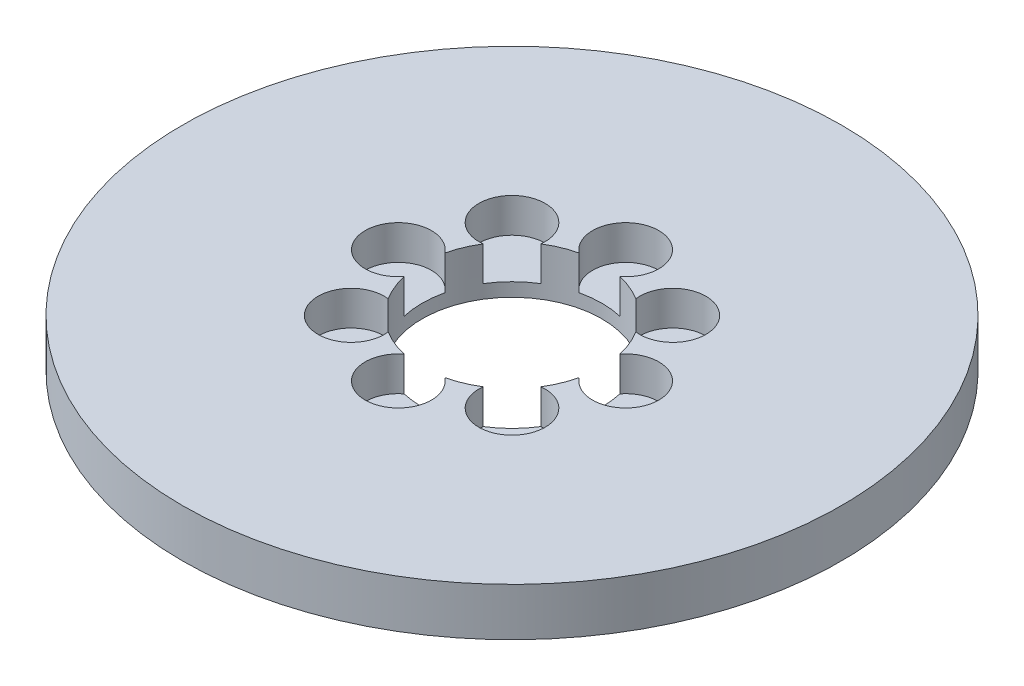
ISO-10303-21;
HEADER;
FILE_DESCRIPTION(('STEP AP214'),'2;1');
FILE_NAME('part.step','',(''),(''),'','','');
FILE_SCHEMA(('AUTOMOTIVE_DESIGN { 1 0 10303 214 1 1 1 1 }'));
ENDSEC;
DATA;
#1=APPLICATION_CONTEXT('core data for automotive mechanical design processes');
#2=APPLICATION_PROTOCOL_DEFINITION('international standard','automotive_design',2000,#1);
#3=PRODUCT_CONTEXT('',#1,'mechanical');
#4=PRODUCT('Part','Part','',(#3));
#5=PRODUCT_RELATED_PRODUCT_CATEGORY('part','',(#4));
#6=PRODUCT_DEFINITION_FORMATION('','',#4);
#7=PRODUCT_DEFINITION_CONTEXT('part definition',#1,'design');
#8=PRODUCT_DEFINITION('design','',#6,#7);
#9=PRODUCT_DEFINITION_SHAPE('','',#8);
#10=(LENGTH_UNIT() NAMED_UNIT(*) SI_UNIT(.MILLI.,.METRE.));
#11=(NAMED_UNIT(*) PLANE_ANGLE_UNIT() SI_UNIT($,.RADIAN.));
#12=(NAMED_UNIT(*) SI_UNIT($,.STERADIAN.) SOLID_ANGLE_UNIT());
#13=UNCERTAINTY_MEASURE_WITH_UNIT(LENGTH_MEASURE(1.E-05),#10,'distance_accuracy_value','');
#14=(GEOMETRIC_REPRESENTATION_CONTEXT(3) GLOBAL_UNCERTAINTY_ASSIGNED_CONTEXT((#13)) GLOBAL_UNIT_ASSIGNED_CONTEXT((#10,
#11,#12)) REPRESENTATION_CONTEXT('',''));
#15=CARTESIAN_POINT('',(0.,0.,0.));
#16=DIRECTION('',(0.,0.,1.));
#17=DIRECTION('',(1.,0.,0.));
#18=AXIS2_PLACEMENT_3D('',#15,#16,#17);
#19=CARTESIAN_POINT('',(0.,4.,0.));
#20=DIRECTION('',(0.,-1.,0.));
#21=DIRECTION('',(0.,0.,-1.));
#22=AXIS2_PLACEMENT_3D('',#19,#20,#21);
#23=CYLINDRICAL_SURFACE('',#22,27.5);
#24=CARTESIAN_POINT('',(0.,4.,0.));
#25=DIRECTION('',(0.,1.,0.));
#26=DIRECTION('',(0.,0.,1.));
#27=AXIS2_PLACEMENT_3D('',#24,#25,#26);
#28=CIRCLE('',#27,27.5);
#29=CARTESIAN_POINT('',(0.,4.,27.5));
#30=VERTEX_POINT('',#29);
#31=EDGE_CURVE('E195',#30,#30,#28,.T.);
#32=ORIENTED_EDGE('',*,*,#31,.F.);
#33=EDGE_LOOP('',(#32));
#34=FACE_BOUND('',#33,.T.);
#35=CARTESIAN_POINT('',(0.,0.,0.));
#36=DIRECTION('',(0.,1.,0.));
#37=DIRECTION('',(0.,0.,1.));
#38=AXIS2_PLACEMENT_3D('',#35,#36,#37);
#39=CIRCLE('',#38,27.5);
#40=CARTESIAN_POINT('',(0.,0.,27.5));
#41=VERTEX_POINT('',#40);
#42=EDGE_CURVE('E179',#41,#41,#39,.T.);
#43=ORIENTED_EDGE('',*,*,#42,.T.);
#44=EDGE_LOOP('',(#43));
#45=FACE_BOUND('',#44,.T.);
#46=ADVANCED_FACE('F39',(#34,#45),#23,.T.);
#47=CARTESIAN_POINT('',(0.,4.,0.));
#48=DIRECTION('',(0.,1.,0.));
#49=DIRECTION('',(0.,0.,1.));
#50=AXIS2_PLACEMENT_3D('',#47,#48,#49);
#51=PLANE('',#50);
#52=CARTESIAN_POINT('',(0.,4.,9.48682815925262));
#53=DIRECTION('',(0.,1.,0.));
#54=DIRECTION('',(1.,0.,0.));
#55=AXIS2_PLACEMENT_3D('',#52,#53,#54);
#56=CIRCLE('',#55,2.7653774742238);
#57=CARTESIAN_POINT('',(-1.69910178107267,4.,7.30500192591047));
#58=VERTEX_POINT('',#57);
#59=CARTESIAN_POINT('',(1.69910178107272,4.,7.30500192591046));
#60=VERTEX_POINT('',#59);
#61=EDGE_CURVE('E176',#58,#60,#56,.T.);
#62=ORIENTED_EDGE('',*,*,#61,.F.);
#63=CARTESIAN_POINT('',(0.,4.,0.));
#64=DIRECTION('',(0.,1.,0.));
#65=DIRECTION('',(0.,0.,1.));
#66=AXIS2_PLACEMENT_3D('',#63,#64,#65);
#67=CIRCLE('',#66,7.5);
#68=CARTESIAN_POINT('',(-3.96397000706943,4.,6.36686278971472));
#69=VERTEX_POINT('',#68);
#70=EDGE_CURVE('E166',#69,#58,#67,.T.);
#71=ORIENTED_EDGE('',*,*,#70,.F.);
#72=CARTESIAN_POINT('',(-6.70820052335901,4.,6.70820052335903));
#73=DIRECTION('',(0.,1.,0.));
#74=DIRECTION('',(0.707106781186549,0.,0.707106781186546));
#75=AXIS2_PLACEMENT_3D('',#72,#73,#74);
#76=CIRCLE('',#75,2.7653774742238);
#77=CARTESIAN_POINT('',(-6.36686278971471,4.,3.96397000706945));
#78=VERTEX_POINT('',#77);
#79=EDGE_CURVE('E147',#78,#69,#76,.T.);
#80=ORIENTED_EDGE('',*,*,#79,.F.);
#81=CARTESIAN_POINT('',(-7.30500192591046,4.,1.69910178107269));
#82=VERTEX_POINT('',#81);
#83=EDGE_CURVE('E180',#82,#78,#67,.T.);
#84=ORIENTED_EDGE('',*,*,#83,.F.);
#85=CARTESIAN_POINT('',(-9.48682815925262,4.,0.));
#86=DIRECTION('',(0.,1.,0.));
#87=DIRECTION('',(0.,0.,1.));
#88=AXIS2_PLACEMENT_3D('',#85,#86,#87);
#89=CIRCLE('',#88,2.7653774742238);
#90=CARTESIAN_POINT('',(-7.30500192591046,4.,-1.69910178107269));
#91=VERTEX_POINT('',#90);
#92=EDGE_CURVE('E186',#91,#82,#89,.T.);
#93=ORIENTED_EDGE('',*,*,#92,.F.);
#94=CARTESIAN_POINT('',(-6.36686278971477,4.,-3.96397000706936));
#95=VERTEX_POINT('',#94);
#96=EDGE_CURVE('E182',#95,#91,#67,.T.);
#97=ORIENTED_EDGE('',*,*,#96,.F.);
#98=CARTESIAN_POINT('',(-6.7082005233591,4.,-6.70820052335894));
#99=DIRECTION('',(0.,1.,0.));
#100=DIRECTION('',(-0.707106781186539,0.,0.707106781186556));
#101=AXIS2_PLACEMENT_3D('',#98,#99,#100);
#102=CIRCLE('',#101,2.7653774742238);
#103=CARTESIAN_POINT('',(-3.96397000706952,4.,-6.36686278971467));
#104=VERTEX_POINT('',#103);
#105=EDGE_CURVE('E446',#104,#95,#102,.T.);
#106=ORIENTED_EDGE('',*,*,#105,.F.);
#107=CARTESIAN_POINT('',(-1.69910178107277,4.,-7.30500192591045));
#108=VERTEX_POINT('',#107);
#109=EDGE_CURVE('E452',#108,#104,#67,.T.);
#110=ORIENTED_EDGE('',*,*,#109,.F.);
#111=CARTESIAN_POINT('',(0.,4.,-9.48682815925262));
#112=DIRECTION('',(0.,1.,0.));
#113=DIRECTION('',(-1.,0.,0.));
#114=AXIS2_PLACEMENT_3D('',#111,#112,#113);
#115=CIRCLE('',#114,2.7653774742238);
#116=CARTESIAN_POINT('',(1.69910178107262,4.,-7.30500192591048));
#117=VERTEX_POINT('',#116);
#118=EDGE_CURVE('E477',#117,#108,#115,.T.);
#119=ORIENTED_EDGE('',*,*,#118,.F.);
#120=CARTESIAN_POINT('',(3.96397000706938,4.,-6.36686278971475));
#121=VERTEX_POINT('',#120);
#122=EDGE_CURVE('E460',#121,#117,#67,.T.);
#123=ORIENTED_EDGE('',*,*,#122,.F.);
#124=CARTESIAN_POINT('',(6.70820052335896,4.,-6.70820052335908));
#125=DIRECTION('',(0.,1.,0.));
#126=DIRECTION('',(-0.707106781186554,0.,-0.707106781186541));
#127=AXIS2_PLACEMENT_3D('',#124,#125,#126);
#128=CIRCLE('',#127,2.7653774742238);
#129=CARTESIAN_POINT('',(6.36686278971469,4.,-3.96397000706949));
#130=VERTEX_POINT('',#129);
#131=EDGE_CURVE('E464',#130,#121,#128,.T.);
#132=ORIENTED_EDGE('',*,*,#131,.F.);
#133=CARTESIAN_POINT('',(7.30500192591046,4.,-1.69910178107269));
#134=VERTEX_POINT('',#133);
#135=EDGE_CURVE('E459',#134,#130,#67,.T.);
#136=ORIENTED_EDGE('',*,*,#135,.F.);
#137=CARTESIAN_POINT('',(9.48682815925262,4.,0.));
#138=DIRECTION('',(0.,1.,0.));
#139=DIRECTION('',(0.,0.,-1.));
#140=AXIS2_PLACEMENT_3D('',#137,#138,#139);
#141=CIRCLE('',#140,2.7653774742238);
#142=CARTESIAN_POINT('',(7.30500192591046,4.,1.69910178107269));
#143=VERTEX_POINT('',#142);
#144=EDGE_CURVE('E469',#143,#134,#141,.T.);
#145=ORIENTED_EDGE('',*,*,#144,.F.);
#146=CARTESIAN_POINT('',(6.36686278971474,4.,3.9639700070694));
#147=VERTEX_POINT('',#146);
#148=EDGE_CURVE('E181',#147,#143,#67,.T.);
#149=ORIENTED_EDGE('',*,*,#148,.F.);
#150=CARTESIAN_POINT('',(6.70820052335906,4.,6.70820052335898));
#151=DIRECTION('',(0.,1.,0.));
#152=DIRECTION('',(0.707106781186544,0.,-0.707106781186551));
#153=AXIS2_PLACEMENT_3D('',#150,#151,#152);
#154=CIRCLE('',#153,2.7653774742238);
#155=CARTESIAN_POINT('',(3.96397000706947,4.,6.3668627897147));
#156=VERTEX_POINT('',#155);
#157=EDGE_CURVE('E475',#156,#147,#154,.T.);
#158=ORIENTED_EDGE('',*,*,#157,.F.);
#159=EDGE_CURVE('E177',#60,#156,#67,.T.);
#160=ORIENTED_EDGE('',*,*,#159,.F.);
#161=EDGE_LOOP('',(#62,#71,#80,#84,#93,#97,#106,#110,#119,#123,#132,#136,#145,#149,#158,#160));
#162=FACE_BOUND('',#161,.T.);
#163=ORIENTED_EDGE('',*,*,#31,.T.);
#164=EDGE_LOOP('',(#163));
#165=FACE_BOUND('',#164,.T.);
#166=ADVANCED_FACE('F172',(#162,#165),#51,.T.);
#167=CARTESIAN_POINT('',(0.,0.,0.));
#168=DIRECTION('',(0.,1.,0.));
#169=DIRECTION('',(0.,0.,1.));
#170=AXIS2_PLACEMENT_3D('',#167,#168,#169);
#171=PLANE('',#170);
#172=CARTESIAN_POINT('',(0.,0.,0.));
#173=DIRECTION('',(0.,1.,0.));
#174=DIRECTION('',(0.,0.,1.));
#175=AXIS2_PLACEMENT_3D('',#172,#173,#174);
#176=CIRCLE('',#175,7.5);
#177=CARTESIAN_POINT('',(0.,0.,7.5));
#178=VERTEX_POINT('',#177);
#179=EDGE_CURVE('E187',#178,#178,#176,.T.);
#180=ORIENTED_EDGE('',*,*,#179,.T.);
#181=EDGE_LOOP('',(#180));
#182=FACE_BOUND('',#181,.T.);
#183=ORIENTED_EDGE('',*,*,#42,.F.);
#184=EDGE_LOOP('',(#183));
#185=FACE_BOUND('',#184,.T.);
#186=ADVANCED_FACE('F270',(#182,#185),#171,.F.);
#187=CARTESIAN_POINT('',(0.,4.,0.));
#188=DIRECTION('',(0.,-1.,0.));
#189=DIRECTION('',(0.,0.,-1.));
#190=AXIS2_PLACEMENT_3D('',#187,#188,#189);
#191=CYLINDRICAL_SURFACE('',#190,7.5);
#192=DIRECTION('',(0.,1.,0.));
#193=VECTOR('',#192,1.);
#194=CARTESIAN_POINT('',(-1.69910178107267,2.56374184246657,7.30500192591047));
#195=LINE('',#194,#193);
#196=CARTESIAN_POINT('',(-1.69910178107267,1.12748368493314,7.30500192591047));
#197=VERTEX_POINT('',#196);
#198=EDGE_CURVE('E11',#197,#58,#195,.T.);
#199=ORIENTED_EDGE('',*,*,#198,.F.);
#200=CARTESIAN_POINT('',(0.,1.12748368493314,0.));
#201=DIRECTION('',(0.,1.,0.));
#202=DIRECTION('',(0.,0.,1.));
#203=AXIS2_PLACEMENT_3D('',#200,#201,#202);
#204=CIRCLE('',#203,7.5);
#205=CARTESIAN_POINT('',(1.69910178107272,1.12748368493314,7.30500192591046));
#206=VERTEX_POINT('',#205);
#207=EDGE_CURVE('E250',#197,#206,#204,.T.);
#208=ORIENTED_EDGE('',*,*,#207,.T.);
#209=DIRECTION('',(0.,1.,0.));
#210=VECTOR('',#209,1.);
#211=CARTESIAN_POINT('',(1.69910178107272,2.56374184246657,7.30500192591046));
#212=LINE('',#211,#210);
#213=EDGE_CURVE('E46',#60,#206,#212,.F.);
#214=ORIENTED_EDGE('',*,*,#213,.F.);
#215=ORIENTED_EDGE('',*,*,#159,.T.);
#216=DIRECTION('',(0.,1.,0.));
#217=VECTOR('',#216,1.);
#218=CARTESIAN_POINT('',(3.96397000706947,2.56374184246657,6.3668627897147));
#219=LINE('',#218,#217);
#220=CARTESIAN_POINT('',(3.96397000706947,1.12748368493314,6.3668627897147));
#221=VERTEX_POINT('',#220);
#222=EDGE_CURVE('E244',#221,#156,#219,.T.);
#223=ORIENTED_EDGE('',*,*,#222,.F.);
#224=CARTESIAN_POINT('',(0.,1.12748368493314,0.));
#225=DIRECTION('',(0.,1.,0.));
#226=DIRECTION('',(0.,0.,1.));
#227=AXIS2_PLACEMENT_3D('',#224,#225,#226);
#228=CIRCLE('',#227,7.5);
#229=CARTESIAN_POINT('',(6.36686278971474,1.12748368493314,3.9639700070694));
#230=VERTEX_POINT('',#229);
#231=EDGE_CURVE('E238',#221,#230,#228,.T.);
#232=ORIENTED_EDGE('',*,*,#231,.T.);
#233=DIRECTION('',(0.,1.,0.));
#234=VECTOR('',#233,1.);
#235=CARTESIAN_POINT('',(6.36686278971474,2.56374184246657,3.9639700070694));
#236=LINE('',#235,#234);
#237=EDGE_CURVE('E242',#147,#230,#236,.F.);
#238=ORIENTED_EDGE('',*,*,#237,.F.);
#239=ORIENTED_EDGE('',*,*,#148,.T.);
#240=DIRECTION('',(0.,1.,0.));
#241=VECTOR('',#240,1.);
#242=CARTESIAN_POINT('',(7.30500192591047,2.56374184246657,1.69910178107269));
#243=LINE('',#242,#241);
#244=CARTESIAN_POINT('',(7.30500192591046,1.12748368493314,1.69910178107269));
#245=VERTEX_POINT('',#244);
#246=EDGE_CURVE('E236',#245,#143,#243,.T.);
#247=ORIENTED_EDGE('',*,*,#246,.F.);
#248=CARTESIAN_POINT('',(0.,1.12748368493314,0.));
#249=DIRECTION('',(0.,1.,0.));
#250=DIRECTION('',(0.,0.,1.));
#251=AXIS2_PLACEMENT_3D('',#248,#249,#250);
#252=CIRCLE('',#251,7.5);
#253=CARTESIAN_POINT('',(7.30500192591046,1.12748368493314,-1.69910178107269));
#254=VERTEX_POINT('',#253);
#255=EDGE_CURVE('E235',#245,#254,#252,.T.);
#256=ORIENTED_EDGE('',*,*,#255,.T.);
#257=DIRECTION('',(0.,1.,0.));
#258=VECTOR('',#257,1.);
#259=CARTESIAN_POINT('',(7.30500192591047,2.56374184246657,-1.69910178107269));
#260=LINE('',#259,#258);
#261=EDGE_CURVE('E234',#134,#254,#260,.F.);
#262=ORIENTED_EDGE('',*,*,#261,.F.);
#263=ORIENTED_EDGE('',*,*,#135,.T.);
#264=DIRECTION('',(0.,1.,0.));
#265=VECTOR('',#264,1.);
#266=CARTESIAN_POINT('',(6.36686278971469,2.56374184246657,-3.96397000706949));
#267=LINE('',#266,#265);
#268=CARTESIAN_POINT('',(6.36686278971469,1.12748368493314,-3.96397000706949));
#269=VERTEX_POINT('',#268);
#270=EDGE_CURVE('E229',#269,#130,#267,.T.);
#271=ORIENTED_EDGE('',*,*,#270,.F.);
#272=CARTESIAN_POINT('',(0.,1.12748368493314,0.));
#273=DIRECTION('',(0.,1.,0.));
#274=DIRECTION('',(0.,0.,1.));
#275=AXIS2_PLACEMENT_3D('',#272,#273,#274);
#276=CIRCLE('',#275,7.5);
#277=CARTESIAN_POINT('',(3.96397000706938,1.12748368493314,-6.36686278971475));
#278=VERTEX_POINT('',#277);
#279=EDGE_CURVE('E221',#269,#278,#276,.T.);
#280=ORIENTED_EDGE('',*,*,#279,.T.);
#281=DIRECTION('',(0.,1.,0.));
#282=VECTOR('',#281,1.);
#283=CARTESIAN_POINT('',(3.96397000706938,2.56374184246657,-6.36686278971476));
#284=LINE('',#283,#282);
#285=EDGE_CURVE('E230',#121,#278,#284,.F.);
#286=ORIENTED_EDGE('',*,*,#285,.F.);
#287=ORIENTED_EDGE('',*,*,#122,.T.);
#288=DIRECTION('',(0.,1.,0.));
#289=VECTOR('',#288,1.);
#290=CARTESIAN_POINT('',(1.69910178107262,2.56374184246657,-7.30500192591048));
#291=LINE('',#290,#289);
#292=CARTESIAN_POINT('',(1.69910178107262,1.12748368493314,-7.30500192591048));
#293=VERTEX_POINT('',#292);
#294=EDGE_CURVE('E225',#293,#117,#291,.T.);
#295=ORIENTED_EDGE('',*,*,#294,.F.);
#296=CARTESIAN_POINT('',(0.,1.12748368493314,0.));
#297=DIRECTION('',(0.,1.,0.));
#298=DIRECTION('',(0.,0.,1.));
#299=AXIS2_PLACEMENT_3D('',#296,#297,#298);
#300=CIRCLE('',#299,7.5);
#301=CARTESIAN_POINT('',(-1.69910178107277,1.12748368493314,-7.30500192591045));
#302=VERTEX_POINT('',#301);
#303=EDGE_CURVE('E216',#293,#302,#300,.T.);
#304=ORIENTED_EDGE('',*,*,#303,.T.);
#305=DIRECTION('',(0.,1.,0.));
#306=VECTOR('',#305,1.);
#307=CARTESIAN_POINT('',(-1.69910178107277,2.56374184246657,-7.30500192591045));
#308=LINE('',#307,#306);
#309=EDGE_CURVE('E218',#108,#302,#308,.F.);
#310=ORIENTED_EDGE('',*,*,#309,.F.);
#311=ORIENTED_EDGE('',*,*,#109,.T.);
#312=DIRECTION('',(0.,1.,0.));
#313=VECTOR('',#312,1.);
#314=CARTESIAN_POINT('',(-3.96397000706952,2.56374184246657,-6.36686278971467));
#315=LINE('',#314,#313);
#316=CARTESIAN_POINT('',(-3.96397000706952,1.12748368493314,-6.36686278971467));
#317=VERTEX_POINT('',#316);
#318=EDGE_CURVE('E212',#317,#104,#315,.T.);
#319=ORIENTED_EDGE('',*,*,#318,.F.);
#320=CARTESIAN_POINT('',(0.,1.12748368493314,0.));
#321=DIRECTION('',(0.,1.,0.));
#322=DIRECTION('',(0.,0.,1.));
#323=AXIS2_PLACEMENT_3D('',#320,#321,#322);
#324=CIRCLE('',#323,7.5);
#325=CARTESIAN_POINT('',(-6.36686278971477,1.12748368493314,-3.96397000706936));
#326=VERTEX_POINT('',#325);
#327=EDGE_CURVE('E208',#317,#326,#324,.T.);
#328=ORIENTED_EDGE('',*,*,#327,.T.);
#329=DIRECTION('',(0.,1.,0.));
#330=VECTOR('',#329,1.);
#331=CARTESIAN_POINT('',(-6.36686278971477,2.56374184246657,-3.96397000706936));
#332=LINE('',#331,#330);
#333=EDGE_CURVE('E211',#95,#326,#332,.F.);
#334=ORIENTED_EDGE('',*,*,#333,.F.);
#335=ORIENTED_EDGE('',*,*,#96,.T.);
#336=DIRECTION('',(0.,1.,0.));
#337=VECTOR('',#336,1.);
#338=CARTESIAN_POINT('',(-7.30500192591047,2.56374184246657,-1.69910178107269));
#339=LINE('',#338,#337);
#340=CARTESIAN_POINT('',(-7.30500192591046,1.12748368493314,-1.69910178107269));
#341=VERTEX_POINT('',#340);
#342=EDGE_CURVE('E201',#341,#91,#339,.T.);
#343=ORIENTED_EDGE('',*,*,#342,.F.);
#344=CARTESIAN_POINT('',(0.,1.12748368493314,0.));
#345=DIRECTION('',(0.,1.,0.));
#346=DIRECTION('',(0.,0.,1.));
#347=AXIS2_PLACEMENT_3D('',#344,#345,#346);
#348=CIRCLE('',#347,7.5);
#349=CARTESIAN_POINT('',(-7.30500192591046,1.12748368493314,1.69910178107269));
#350=VERTEX_POINT('',#349);
#351=EDGE_CURVE('E194',#341,#350,#348,.T.);
#352=ORIENTED_EDGE('',*,*,#351,.T.);
#353=DIRECTION('',(0.,1.,0.));
#354=VECTOR('',#353,1.);
#355=CARTESIAN_POINT('',(-7.30500192591047,2.56374184246657,1.69910178107269));
#356=LINE('',#355,#354);
#357=EDGE_CURVE('E199',#82,#350,#356,.F.);
#358=ORIENTED_EDGE('',*,*,#357,.F.);
#359=ORIENTED_EDGE('',*,*,#83,.T.);
#360=DIRECTION('',(0.,1.,0.));
#361=VECTOR('',#360,1.);
#362=CARTESIAN_POINT('',(-6.36686278971472,2.56374184246657,3.96397000706945));
#363=LINE('',#362,#361);
#364=CARTESIAN_POINT('',(-6.36686278971471,1.12748368493314,3.96397000706945));
#365=VERTEX_POINT('',#364);
#366=EDGE_CURVE('E160',#365,#78,#363,.T.);
#367=ORIENTED_EDGE('',*,*,#366,.F.);
#368=CARTESIAN_POINT('',(0.,1.12748368493314,0.));
#369=DIRECTION('',(0.,1.,0.));
#370=DIRECTION('',(0.,0.,1.));
#371=AXIS2_PLACEMENT_3D('',#368,#369,#370);
#372=CIRCLE('',#371,7.5);
#373=CARTESIAN_POINT('',(-3.96397000706943,1.12748368493314,6.36686278971472));
#374=VERTEX_POINT('',#373);
#375=EDGE_CURVE('E168',#365,#374,#372,.T.);
#376=ORIENTED_EDGE('',*,*,#375,.T.);
#377=DIRECTION('',(0.,1.,0.));
#378=VECTOR('',#377,1.);
#379=CARTESIAN_POINT('',(-3.96397000706943,2.56374184246657,6.36686278971473));
#380=LINE('',#379,#378);
#381=EDGE_CURVE('E152',#69,#374,#380,.F.);
#382=ORIENTED_EDGE('',*,*,#381,.F.);
#383=ORIENTED_EDGE('',*,*,#70,.T.);
#384=EDGE_LOOP('',(#199,#208,#214,#215,#223,#232,#238,#239,#247,#256,#262,#263,#271,#280,#286,
#287,#295,#304,#310,#311,#319,#328,#334,#335,#343,#352,#358,#359,#367,#376,#382,#383));
#385=FACE_BOUND('',#384,.T.);
#386=ORIENTED_EDGE('',*,*,#179,.F.);
#387=EDGE_LOOP('',(#386));
#388=FACE_BOUND('',#387,.T.);
#389=ADVANCED_FACE('F170',(#385,#388),#191,.F.);
#390=CARTESIAN_POINT('',(-9.48682815925262,1.12748368493314,0.));
#391=DIRECTION('',(0.,1.,0.));
#392=DIRECTION('',(0.,0.,1.));
#393=AXIS2_PLACEMENT_3D('',#390,#391,#392);
#394=CYLINDRICAL_SURFACE('',#393,2.7653774742238);
#395=ORIENTED_EDGE('',*,*,#342,.T.);
#396=ORIENTED_EDGE('',*,*,#92,.T.);
#397=ORIENTED_EDGE('',*,*,#357,.T.);
#398=CARTESIAN_POINT('',(-9.48682815925262,1.12748368493314,0.));
#399=DIRECTION('',(0.,1.,0.));
#400=DIRECTION('',(0.,0.,1.));
#401=AXIS2_PLACEMENT_3D('',#398,#399,#400);
#402=CIRCLE('',#401,2.7653774742238);
#403=EDGE_CURVE('E191',#341,#350,#402,.T.);
#404=ORIENTED_EDGE('',*,*,#403,.F.);
#405=EDGE_LOOP('',(#395,#396,#397,#404));
#406=FACE_BOUND('',#405,.T.);
#407=ADVANCED_FACE('F279',(#406),#394,.F.);
#408=CARTESIAN_POINT('',(-9.48682815925262,1.12748368493314,0.));
#409=DIRECTION('',(0.,1.,0.));
#410=DIRECTION('',(0.,0.,1.));
#411=AXIS2_PLACEMENT_3D('',#408,#409,#410);
#412=PLANE('',#411);
#413=ORIENTED_EDGE('',*,*,#403,.T.);
#414=ORIENTED_EDGE('',*,*,#351,.F.);
#415=EDGE_LOOP('',(#413,#414));
#416=FACE_BOUND('',#415,.T.);
#417=ADVANCED_FACE('F285',(#416),#412,.T.);
#418=CARTESIAN_POINT('',(-6.70820052335901,1.12748368493314,6.70820052335903));
#419=DIRECTION('',(0.,1.,0.));
#420=DIRECTION('',(0.,0.,1.));
#421=AXIS2_PLACEMENT_3D('',#418,#419,#420);
#422=CYLINDRICAL_SURFACE('',#421,2.7653774742238);
#423=ORIENTED_EDGE('',*,*,#366,.T.);
#424=ORIENTED_EDGE('',*,*,#79,.T.);
#425=ORIENTED_EDGE('',*,*,#381,.T.);
#426=CARTESIAN_POINT('',(-6.70820052335901,1.12748368493314,6.70820052335903));
#427=DIRECTION('',(0.,1.,0.));
#428=DIRECTION('',(0.707106781186549,0.,0.707106781186546));
#429=AXIS2_PLACEMENT_3D('',#426,#427,#428);
#430=CIRCLE('',#429,2.7653774742238);
#431=EDGE_CURVE('E165',#365,#374,#430,.T.);
#432=ORIENTED_EDGE('',*,*,#431,.F.);
#433=EDGE_LOOP('',(#423,#424,#425,#432));
#434=FACE_BOUND('',#433,.T.);
#435=ADVANCED_FACE('F155',(#434),#422,.F.);
#436=CARTESIAN_POINT('',(-6.70820052335901,1.12748368493314,6.70820052335903));
#437=DIRECTION('',(0.,1.,0.));
#438=DIRECTION('',(0.707106781186549,0.,0.707106781186546));
#439=AXIS2_PLACEMENT_3D('',#436,#437,#438);
#440=PLANE('',#439);
#441=ORIENTED_EDGE('',*,*,#431,.T.);
#442=ORIENTED_EDGE('',*,*,#375,.F.);
#443=EDGE_LOOP('',(#441,#442));
#444=FACE_BOUND('',#443,.T.);
#445=ADVANCED_FACE('F288',(#444),#440,.T.);
#446=CARTESIAN_POINT('',(-6.7082005233591,1.12748368493314,-6.70820052335894));
#447=DIRECTION('',(0.,1.,0.));
#448=DIRECTION('',(0.,0.,1.));
#449=AXIS2_PLACEMENT_3D('',#446,#447,#448);
#450=CYLINDRICAL_SURFACE('',#449,2.7653774742238);
#451=ORIENTED_EDGE('',*,*,#318,.T.);
#452=ORIENTED_EDGE('',*,*,#105,.T.);
#453=ORIENTED_EDGE('',*,*,#333,.T.);
#454=CARTESIAN_POINT('',(-6.7082005233591,1.12748368493314,-6.70820052335894));
#455=DIRECTION('',(0.,1.,0.));
#456=DIRECTION('',(-0.707106781186539,0.,0.707106781186556));
#457=AXIS2_PLACEMENT_3D('',#454,#455,#456);
#458=CIRCLE('',#457,2.7653774742238);
#459=EDGE_CURVE('E447',#317,#326,#458,.T.);
#460=ORIENTED_EDGE('',*,*,#459,.F.);
#461=EDGE_LOOP('',(#451,#452,#453,#460));
#462=FACE_BOUND('',#461,.T.);
#463=ADVANCED_FACE('F295',(#462),#450,.F.);
#464=CARTESIAN_POINT('',(-6.7082005233591,1.12748368493314,-6.70820052335894));
#465=DIRECTION('',(0.,1.,0.));
#466=DIRECTION('',(-0.707106781186539,0.,0.707106781186556));
#467=AXIS2_PLACEMENT_3D('',#464,#465,#466);
#468=PLANE('',#467);
#469=ORIENTED_EDGE('',*,*,#459,.T.);
#470=ORIENTED_EDGE('',*,*,#327,.F.);
#471=EDGE_LOOP('',(#469,#470));
#472=FACE_BOUND('',#471,.T.);
#473=ADVANCED_FACE('F375',(#472),#468,.T.);
#474=CARTESIAN_POINT('',(0.,1.12748368493314,-9.48682815925262));
#475=DIRECTION('',(0.,1.,0.));
#476=DIRECTION('',(0.,0.,1.));
#477=AXIS2_PLACEMENT_3D('',#474,#475,#476);
#478=CYLINDRICAL_SURFACE('',#477,2.7653774742238);
#479=ORIENTED_EDGE('',*,*,#294,.T.);
#480=ORIENTED_EDGE('',*,*,#118,.T.);
#481=ORIENTED_EDGE('',*,*,#309,.T.);
#482=CARTESIAN_POINT('',(0.,1.12748368493314,-9.48682815925262));
#483=DIRECTION('',(0.,1.,0.));
#484=DIRECTION('',(-1.,0.,0.));
#485=AXIS2_PLACEMENT_3D('',#482,#483,#484);
#486=CIRCLE('',#485,2.7653774742238);
#487=EDGE_CURVE('E467',#293,#302,#486,.T.);
#488=ORIENTED_EDGE('',*,*,#487,.F.);
#489=EDGE_LOOP('',(#479,#480,#481,#488));
#490=FACE_BOUND('',#489,.T.);
#491=ADVANCED_FACE('F361',(#490),#478,.F.);
#492=CARTESIAN_POINT('',(0.,1.12748368493314,-9.48682815925262));
#493=DIRECTION('',(0.,1.,0.));
#494=DIRECTION('',(-1.,0.,0.));
#495=AXIS2_PLACEMENT_3D('',#492,#493,#494);
#496=PLANE('',#495);
#497=ORIENTED_EDGE('',*,*,#487,.T.);
#498=ORIENTED_EDGE('',*,*,#303,.F.);
#499=EDGE_LOOP('',(#497,#498));
#500=FACE_BOUND('',#499,.T.);
#501=ADVANCED_FACE('F297',(#500),#496,.T.);
#502=CARTESIAN_POINT('',(6.70820052335896,1.12748368493314,-6.70820052335908));
#503=DIRECTION('',(0.,1.,0.));
#504=DIRECTION('',(0.,0.,1.));
#505=AXIS2_PLACEMENT_3D('',#502,#503,#504);
#506=CYLINDRICAL_SURFACE('',#505,2.7653774742238);
#507=ORIENTED_EDGE('',*,*,#270,.T.);
#508=ORIENTED_EDGE('',*,*,#131,.T.);
#509=ORIENTED_EDGE('',*,*,#285,.T.);
#510=CARTESIAN_POINT('',(6.70820052335896,1.12748368493314,-6.70820052335908));
#511=DIRECTION('',(0.,1.,0.));
#512=DIRECTION('',(-0.707106781186554,0.,-0.707106781186541));
#513=AXIS2_PLACEMENT_3D('',#510,#511,#512);
#514=CIRCLE('',#513,2.7653774742238);
#515=EDGE_CURVE('E470',#269,#278,#514,.T.);
#516=ORIENTED_EDGE('',*,*,#515,.F.);
#517=EDGE_LOOP('',(#507,#508,#509,#516));
#518=FACE_BOUND('',#517,.T.);
#519=ADVANCED_FACE('F294',(#518),#506,.F.);
#520=CARTESIAN_POINT('',(6.70820052335896,1.12748368493314,-6.70820052335908));
#521=DIRECTION('',(0.,1.,0.));
#522=DIRECTION('',(-0.707106781186554,0.,-0.707106781186541));
#523=AXIS2_PLACEMENT_3D('',#520,#521,#522);
#524=PLANE('',#523);
#525=ORIENTED_EDGE('',*,*,#515,.T.);
#526=ORIENTED_EDGE('',*,*,#279,.F.);
#527=EDGE_LOOP('',(#525,#526));
#528=FACE_BOUND('',#527,.T.);
#529=ADVANCED_FACE('F300',(#528),#524,.T.);
#530=CARTESIAN_POINT('',(9.48682815925262,1.12748368493314,0.));
#531=DIRECTION('',(0.,1.,0.));
#532=DIRECTION('',(0.,0.,1.));
#533=AXIS2_PLACEMENT_3D('',#530,#531,#532);
#534=CYLINDRICAL_SURFACE('',#533,2.7653774742238);
#535=ORIENTED_EDGE('',*,*,#246,.T.);
#536=ORIENTED_EDGE('',*,*,#144,.T.);
#537=ORIENTED_EDGE('',*,*,#261,.T.);
#538=CARTESIAN_POINT('',(9.48682815925262,1.12748368493314,0.));
#539=DIRECTION('',(0.,1.,0.));
#540=DIRECTION('',(0.,0.,-1.));
#541=AXIS2_PLACEMENT_3D('',#538,#539,#540);
#542=CIRCLE('',#541,2.7653774742238);
#543=EDGE_CURVE('E472',#245,#254,#542,.T.);
#544=ORIENTED_EDGE('',*,*,#543,.F.);
#545=EDGE_LOOP('',(#535,#536,#537,#544));
#546=FACE_BOUND('',#545,.T.);
#547=ADVANCED_FACE('F305',(#546),#534,.F.);
#548=CARTESIAN_POINT('',(9.48682815925262,1.12748368493314,0.));
#549=DIRECTION('',(0.,1.,0.));
#550=DIRECTION('',(0.,0.,-1.));
#551=AXIS2_PLACEMENT_3D('',#548,#549,#550);
#552=PLANE('',#551);
#553=ORIENTED_EDGE('',*,*,#543,.T.);
#554=ORIENTED_EDGE('',*,*,#255,.F.);
#555=EDGE_LOOP('',(#553,#554));
#556=FACE_BOUND('',#555,.T.);
#557=ADVANCED_FACE('F308',(#556),#552,.T.);
#558=CARTESIAN_POINT('',(6.70820052335906,1.12748368493314,6.70820052335898));
#559=DIRECTION('',(0.,1.,0.));
#560=DIRECTION('',(0.,0.,1.));
#561=AXIS2_PLACEMENT_3D('',#558,#559,#560);
#562=CYLINDRICAL_SURFACE('',#561,2.7653774742238);
#563=ORIENTED_EDGE('',*,*,#222,.T.);
#564=ORIENTED_EDGE('',*,*,#157,.T.);
#565=ORIENTED_EDGE('',*,*,#237,.T.);
#566=CARTESIAN_POINT('',(6.70820052335906,1.12748368493314,6.70820052335898));
#567=DIRECTION('',(0.,1.,0.));
#568=DIRECTION('',(0.707106781186544,0.,-0.707106781186551));
#569=AXIS2_PLACEMENT_3D('',#566,#567,#568);
#570=CIRCLE('',#569,2.7653774742238);
#571=EDGE_CURVE('E56',#221,#230,#570,.T.);
#572=ORIENTED_EDGE('',*,*,#571,.F.);
#573=EDGE_LOOP('',(#563,#564,#565,#572));
#574=FACE_BOUND('',#573,.T.);
#575=ADVANCED_FACE('F309',(#574),#562,.F.);
#576=CARTESIAN_POINT('',(6.70820052335906,1.12748368493314,6.70820052335898));
#577=DIRECTION('',(0.,1.,0.));
#578=DIRECTION('',(0.707106781186544,0.,-0.707106781186551));
#579=AXIS2_PLACEMENT_3D('',#576,#577,#578);
#580=PLANE('',#579);
#581=ORIENTED_EDGE('',*,*,#571,.T.);
#582=ORIENTED_EDGE('',*,*,#231,.F.);
#583=EDGE_LOOP('',(#581,#582));
#584=FACE_BOUND('',#583,.T.);
#585=ADVANCED_FACE('F256',(#584),#580,.T.);
#586=CARTESIAN_POINT('',(0.,1.12748368493314,9.48682815925262));
#587=DIRECTION('',(0.,1.,0.));
#588=DIRECTION('',(0.,0.,1.));
#589=AXIS2_PLACEMENT_3D('',#586,#587,#588);
#590=CYLINDRICAL_SURFACE('',#589,2.7653774742238);
#591=ORIENTED_EDGE('',*,*,#198,.T.);
#592=ORIENTED_EDGE('',*,*,#61,.T.);
#593=ORIENTED_EDGE('',*,*,#213,.T.);
#594=CARTESIAN_POINT('',(0.,1.12748368493314,9.48682815925262));
#595=DIRECTION('',(0.,1.,0.));
#596=DIRECTION('',(1.,0.,0.));
#597=AXIS2_PLACEMENT_3D('',#594,#595,#596);
#598=CIRCLE('',#597,2.7653774742238);
#599=EDGE_CURVE('E55',#197,#206,#598,.T.);
#600=ORIENTED_EDGE('',*,*,#599,.F.);
#601=EDGE_LOOP('',(#591,#592,#593,#600));
#602=FACE_BOUND('',#601,.T.);
#603=ADVANCED_FACE('F253',(#602),#590,.F.);
#604=CARTESIAN_POINT('',(0.,1.12748368493314,9.48682815925262));
#605=DIRECTION('',(0.,1.,0.));
#606=DIRECTION('',(1.,0.,0.));
#607=AXIS2_PLACEMENT_3D('',#604,#605,#606);
#608=PLANE('',#607);
#609=ORIENTED_EDGE('',*,*,#599,.T.);
#610=ORIENTED_EDGE('',*,*,#207,.F.);
#611=EDGE_LOOP('',(#609,#610));
#612=FACE_BOUND('',#611,.T.);
#613=ADVANCED_FACE('F252',(#612),#608,.T.);
#614=CLOSED_SHELL('',(#46,#166,#186,#389,#407,#417,#435,#445,#463,#473,#491,#501,#519,#529,#547,
#557,#575,#585,#603,#613));
#615=MANIFOLD_SOLID_BREP('B2',#614);
#616=ADVANCED_BREP_SHAPE_REPRESENTATION('',(#18,#615),#14);
#617=SHAPE_DEFINITION_REPRESENTATION(#9,#616);
ENDSEC;
END-ISO-10303-21;
